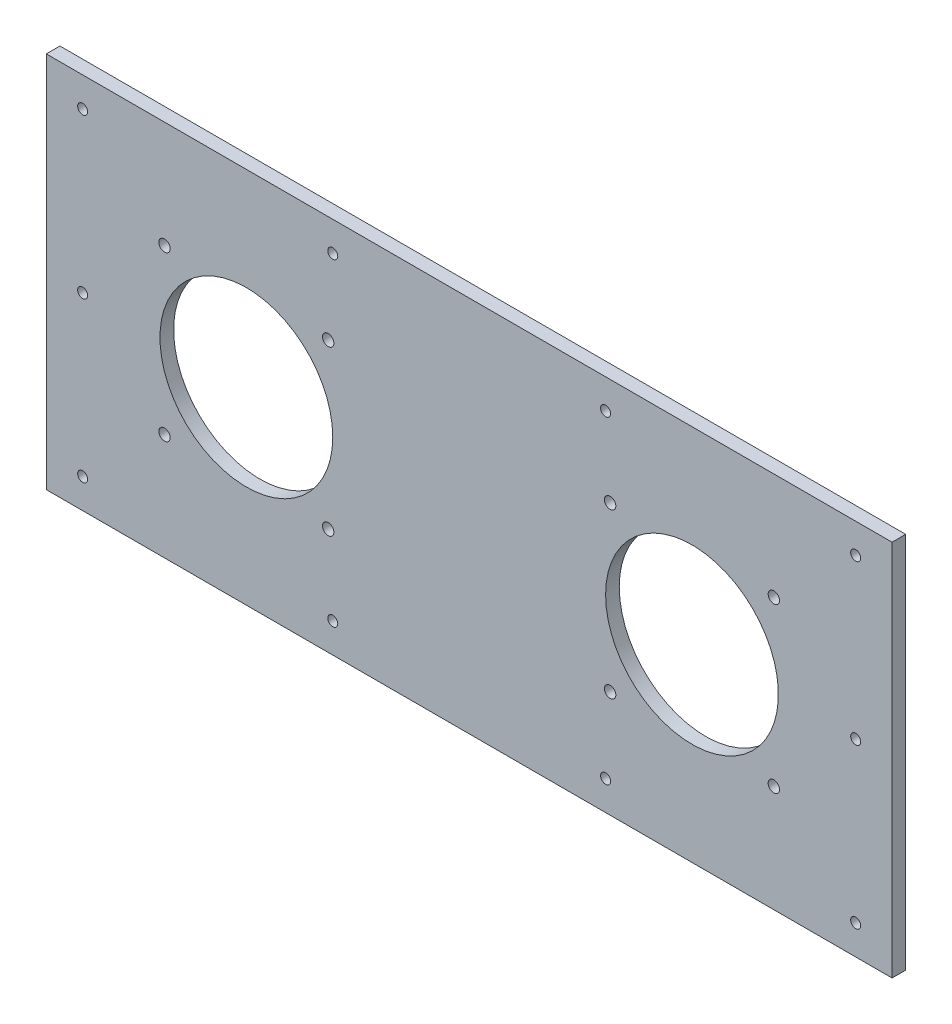
ISO-10303-21;
HEADER;
FILE_DESCRIPTION(('STEP AP214'),'2;1');
FILE_NAME('part.step','',(''),(''),'','','');
FILE_SCHEMA(('AUTOMOTIVE_DESIGN { 1 0 10303 214 1 1 1 1 }'));
ENDSEC;
DATA;
#1=APPLICATION_CONTEXT('core data for automotive mechanical design processes');
#2=APPLICATION_PROTOCOL_DEFINITION('international standard','automotive_design',2000,#1);
#3=PRODUCT_CONTEXT('',#1,'mechanical');
#4=PRODUCT('Part','Part','',(#3));
#5=PRODUCT_RELATED_PRODUCT_CATEGORY('part','',(#4));
#6=PRODUCT_DEFINITION_FORMATION('','',#4);
#7=PRODUCT_DEFINITION_CONTEXT('part definition',#1,'design');
#8=PRODUCT_DEFINITION('design','',#6,#7);
#9=PRODUCT_DEFINITION_SHAPE('','',#8);
#10=(LENGTH_UNIT() NAMED_UNIT(*) SI_UNIT(.MILLI.,.METRE.));
#11=(NAMED_UNIT(*) PLANE_ANGLE_UNIT() SI_UNIT($,.RADIAN.));
#12=(NAMED_UNIT(*) SI_UNIT($,.STERADIAN.) SOLID_ANGLE_UNIT());
#13=UNCERTAINTY_MEASURE_WITH_UNIT(LENGTH_MEASURE(1.E-05),#10,'distance_accuracy_value','');
#14=(GEOMETRIC_REPRESENTATION_CONTEXT(3) GLOBAL_UNCERTAINTY_ASSIGNED_CONTEXT((#13)) GLOBAL_UNIT_ASSIGNED_CONTEXT((#10,
#11,#12)) REPRESENTATION_CONTEXT('',''));
#15=CARTESIAN_POINT('',(0.,0.,0.));
#16=DIRECTION('',(0.,0.,1.));
#17=DIRECTION('',(1.,0.,0.));
#18=AXIS2_PLACEMENT_3D('',#15,#16,#17);
#19=CARTESIAN_POINT('',(0.,0.,6.));
#20=DIRECTION('',(0.,0.,-1.));
#21=DIRECTION('',(-1.,0.,0.));
#22=AXIS2_PLACEMENT_3D('',#19,#20,#21);
#23=PLANE('',#22);
#24=CARTESIAN_POINT('',(-134.,36.,6.));
#25=DIRECTION('',(0.,0.,1.));
#26=DIRECTION('',(1.,0.,0.));
#27=AXIS2_PLACEMENT_3D('',#24,#25,#26);
#28=CIRCLE('',#27,2.5);
#29=CARTESIAN_POINT('',(-131.5,36.,6.));
#30=VERTEX_POINT('',#29);
#31=EDGE_CURVE('E448',#30,#30,#28,.T.);
#32=ORIENTED_EDGE('',*,*,#31,.F.);
#33=EDGE_LOOP('',(#32));
#34=FACE_BOUND('',#33,.T.);
#35=CARTESIAN_POINT('',(-134.,-36.,6.));
#36=DIRECTION('',(0.,0.,1.));
#37=DIRECTION('',(-1.,0.,0.));
#38=AXIS2_PLACEMENT_3D('',#35,#36,#37);
#39=CIRCLE('',#38,2.5);
#40=CARTESIAN_POINT('',(-136.5,-36.,6.));
#41=VERTEX_POINT('',#40);
#42=EDGE_CURVE('E456',#41,#41,#39,.T.);
#43=ORIENTED_EDGE('',*,*,#42,.F.);
#44=EDGE_LOOP('',(#43));
#45=FACE_BOUND('',#44,.T.);
#46=CARTESIAN_POINT('',(-62.,-36.,6.));
#47=DIRECTION('',(0.,0.,1.));
#48=DIRECTION('',(1.,0.,0.));
#49=AXIS2_PLACEMENT_3D('',#46,#47,#48);
#50=CIRCLE('',#49,2.5);
#51=CARTESIAN_POINT('',(-59.5,-36.,6.));
#52=VERTEX_POINT('',#51);
#53=EDGE_CURVE('E464',#52,#52,#50,.T.);
#54=ORIENTED_EDGE('',*,*,#53,.F.);
#55=EDGE_LOOP('',(#54));
#56=FACE_BOUND('',#55,.T.);
#57=CARTESIAN_POINT('',(-62.,36.,6.));
#58=DIRECTION('',(0.,0.,1.));
#59=DIRECTION('',(-1.,0.,0.));
#60=AXIS2_PLACEMENT_3D('',#57,#58,#59);
#61=CIRCLE('',#60,2.50000000000001);
#62=CARTESIAN_POINT('',(-64.5,36.,6.));
#63=VERTEX_POINT('',#62);
#64=EDGE_CURVE('E472',#63,#63,#61,.T.);
#65=ORIENTED_EDGE('',*,*,#64,.F.);
#66=EDGE_LOOP('',(#65));
#67=FACE_BOUND('',#66,.T.);
#68=CARTESIAN_POINT('',(62.,36.,6.));
#69=DIRECTION('',(0.,0.,1.));
#70=DIRECTION('',(1.,0.,0.));
#71=AXIS2_PLACEMENT_3D('',#68,#69,#70);
#72=CIRCLE('',#71,2.50000000000001);
#73=CARTESIAN_POINT('',(64.5,36.,6.));
#74=VERTEX_POINT('',#73);
#75=EDGE_CURVE('E480',#74,#74,#72,.T.);
#76=ORIENTED_EDGE('',*,*,#75,.F.);
#77=EDGE_LOOP('',(#76));
#78=FACE_BOUND('',#77,.T.);
#79=CARTESIAN_POINT('',(61.9999999999999,-36.,6.));
#80=DIRECTION('',(0.,0.,1.));
#81=DIRECTION('',(-1.,0.,0.));
#82=AXIS2_PLACEMENT_3D('',#79,#80,#81);
#83=CIRCLE('',#82,2.5);
#84=CARTESIAN_POINT('',(59.5,-36.,6.));
#85=VERTEX_POINT('',#84);
#86=EDGE_CURVE('E488',#85,#85,#83,.T.);
#87=ORIENTED_EDGE('',*,*,#86,.F.);
#88=EDGE_LOOP('',(#87));
#89=FACE_BOUND('',#88,.T.);
#90=CARTESIAN_POINT('',(134.,-36.0000000000001,6.));
#91=DIRECTION('',(0.,0.,1.));
#92=DIRECTION('',(1.,0.,0.));
#93=AXIS2_PLACEMENT_3D('',#90,#91,#92);
#94=CIRCLE('',#93,2.5);
#95=CARTESIAN_POINT('',(136.5,-36.0000000000001,6.));
#96=VERTEX_POINT('',#95);
#97=EDGE_CURVE('E496',#96,#96,#94,.T.);
#98=ORIENTED_EDGE('',*,*,#97,.F.);
#99=EDGE_LOOP('',(#98));
#100=FACE_BOUND('',#99,.T.);
#101=CARTESIAN_POINT('',(134.,35.9999999999999,6.));
#102=DIRECTION('',(0.,0.,1.));
#103=DIRECTION('',(-1.,0.,0.));
#104=AXIS2_PLACEMENT_3D('',#101,#102,#103);
#105=CIRCLE('',#104,2.5);
#106=CARTESIAN_POINT('',(131.5,35.9999999999999,6.));
#107=VERTEX_POINT('',#106);
#108=EDGE_CURVE('E504',#107,#107,#105,.T.);
#109=ORIENTED_EDGE('',*,*,#108,.F.);
#110=EDGE_LOOP('',(#109));
#111=FACE_BOUND('',#110,.T.);
#112=CARTESIAN_POINT('',(98.,0.,6.));
#113=DIRECTION('',(0.,0.,1.));
#114=DIRECTION('',(-1.,0.,0.));
#115=AXIS2_PLACEMENT_3D('',#112,#113,#114);
#116=CIRCLE('',#115,38.);
#117=CARTESIAN_POINT('',(60.,0.,6.));
#118=VERTEX_POINT('',#117);
#119=EDGE_CURVE('E511',#118,#118,#116,.T.);
#120=ORIENTED_EDGE('',*,*,#119,.F.);
#121=EDGE_LOOP('',(#120));
#122=FACE_BOUND('',#121,.T.);
#123=CARTESIAN_POINT('',(-98.,0.,6.));
#124=DIRECTION('',(0.,0.,1.));
#125=DIRECTION('',(1.,0.,0.));
#126=AXIS2_PLACEMENT_3D('',#123,#124,#125);
#127=CIRCLE('',#126,38.);
#128=CARTESIAN_POINT('',(-60.,0.,6.));
#129=VERTEX_POINT('',#128);
#130=EDGE_CURVE('E142',#129,#129,#127,.T.);
#131=ORIENTED_EDGE('',*,*,#130,.F.);
#132=EDGE_LOOP('',(#131));
#133=FACE_BOUND('',#132,.T.);
#134=DIRECTION('',(0.,-1.,0.));
#135=VECTOR('',#134,1.);
#136=CARTESIAN_POINT('',(-186.,83.,6.));
#137=LINE('',#136,#135);
#138=CARTESIAN_POINT('',(-186.,83.,6.));
#139=VERTEX_POINT('',#138);
#140=CARTESIAN_POINT('',(-186.,-83.,6.));
#141=VERTEX_POINT('',#140);
#142=EDGE_CURVE('E95',#139,#141,#137,.T.);
#143=ORIENTED_EDGE('',*,*,#142,.T.);
#144=DIRECTION('',(1.,0.,0.));
#145=VECTOR('',#144,1.);
#146=CARTESIAN_POINT('',(186.,-83.,6.));
#147=LINE('',#146,#145);
#148=CARTESIAN_POINT('',(186.,-83.,6.));
#149=VERTEX_POINT('',#148);
#150=EDGE_CURVE('E90',#141,#149,#147,.T.);
#151=ORIENTED_EDGE('',*,*,#150,.T.);
#152=DIRECTION('',(0.,1.,0.));
#153=VECTOR('',#152,1.);
#154=CARTESIAN_POINT('',(186.,83.,6.));
#155=LINE('',#154,#153);
#156=CARTESIAN_POINT('',(186.,83.,6.));
#157=VERTEX_POINT('',#156);
#158=EDGE_CURVE('E93',#149,#157,#155,.T.);
#159=ORIENTED_EDGE('',*,*,#158,.T.);
#160=DIRECTION('',(-1.,0.,0.));
#161=VECTOR('',#160,1.);
#162=CARTESIAN_POINT('',(186.,83.,6.));
#163=LINE('',#162,#161);
#164=EDGE_CURVE('E60',#157,#139,#163,.T.);
#165=ORIENTED_EDGE('',*,*,#164,.T.);
#166=EDGE_LOOP('',(#143,#151,#159,#165));
#167=FACE_BOUND('',#166,.T.);
#168=CARTESIAN_POINT('',(-170.,70.,6.));
#169=DIRECTION('',(0.,0.,1.));
#170=DIRECTION('',(1.,0.,0.));
#171=AXIS2_PLACEMENT_3D('',#168,#169,#170);
#172=CIRCLE('',#171,2.20000000000001);
#173=CARTESIAN_POINT('',(-167.8,70.,6.));
#174=VERTEX_POINT('',#173);
#175=EDGE_CURVE('E123',#174,#174,#172,.T.);
#176=ORIENTED_EDGE('',*,*,#175,.F.);
#177=EDGE_LOOP('',(#176));
#178=FACE_BOUND('',#177,.T.);
#179=CARTESIAN_POINT('',(-60.,70.,6.));
#180=DIRECTION('',(0.,0.,1.));
#181=DIRECTION('',(1.,0.,0.));
#182=AXIS2_PLACEMENT_3D('',#179,#180,#181);
#183=CIRCLE('',#182,2.19999999999999);
#184=CARTESIAN_POINT('',(-57.8000000000001,70.,6.));
#185=VERTEX_POINT('',#184);
#186=EDGE_CURVE('E134',#185,#185,#183,.T.);
#187=ORIENTED_EDGE('',*,*,#186,.F.);
#188=EDGE_LOOP('',(#187));
#189=FACE_BOUND('',#188,.T.);
#190=CARTESIAN_POINT('',(59.9999999999999,70.,6.));
#191=DIRECTION('',(0.,0.,1.));
#192=DIRECTION('',(-1.,0.,0.));
#193=AXIS2_PLACEMENT_3D('',#190,#191,#192);
#194=CIRCLE('',#193,2.19999999999999);
#195=CARTESIAN_POINT('',(57.8,70.,6.));
#196=VERTEX_POINT('',#195);
#197=EDGE_CURVE('E215',#196,#196,#194,.T.);
#198=ORIENTED_EDGE('',*,*,#197,.F.);
#199=EDGE_LOOP('',(#198));
#200=FACE_BOUND('',#199,.T.);
#201=CARTESIAN_POINT('',(170.,70.,6.));
#202=DIRECTION('',(0.,0.,1.));
#203=DIRECTION('',(-1.,0.,0.));
#204=AXIS2_PLACEMENT_3D('',#201,#202,#203);
#205=CIRCLE('',#204,2.20000000000001);
#206=CARTESIAN_POINT('',(167.8,70.,6.));
#207=VERTEX_POINT('',#206);
#208=EDGE_CURVE('E206',#207,#207,#205,.T.);
#209=ORIENTED_EDGE('',*,*,#208,.F.);
#210=EDGE_LOOP('',(#209));
#211=FACE_BOUND('',#210,.T.);
#212=CARTESIAN_POINT('',(170.,-70.,6.));
#213=DIRECTION('',(0.,0.,1.));
#214=DIRECTION('',(1.,0.,0.));
#215=AXIS2_PLACEMENT_3D('',#212,#213,#214);
#216=CIRCLE('',#215,2.20000000000001);
#217=CARTESIAN_POINT('',(172.2,-70.,6.));
#218=VERTEX_POINT('',#217);
#219=EDGE_CURVE('E198',#218,#218,#216,.T.);
#220=ORIENTED_EDGE('',*,*,#219,.F.);
#221=EDGE_LOOP('',(#220));
#222=FACE_BOUND('',#221,.T.);
#223=CARTESIAN_POINT('',(59.9999999999999,-70.,6.));
#224=DIRECTION('',(0.,0.,1.));
#225=DIRECTION('',(1.,0.,0.));
#226=AXIS2_PLACEMENT_3D('',#223,#224,#225);
#227=CIRCLE('',#226,2.19999999999999);
#228=CARTESIAN_POINT('',(62.1999999999999,-70.,6.));
#229=VERTEX_POINT('',#228);
#230=EDGE_CURVE('E188',#229,#229,#227,.T.);
#231=ORIENTED_EDGE('',*,*,#230,.F.);
#232=EDGE_LOOP('',(#231));
#233=FACE_BOUND('',#232,.T.);
#234=CARTESIAN_POINT('',(-60.,-70.,6.));
#235=DIRECTION('',(0.,0.,1.));
#236=DIRECTION('',(-1.,0.,0.));
#237=AXIS2_PLACEMENT_3D('',#234,#235,#236);
#238=CIRCLE('',#237,2.19999999999999);
#239=CARTESIAN_POINT('',(-62.2,-70.,6.));
#240=VERTEX_POINT('',#239);
#241=EDGE_CURVE('E179',#240,#240,#238,.T.);
#242=ORIENTED_EDGE('',*,*,#241,.F.);
#243=EDGE_LOOP('',(#242));
#244=FACE_BOUND('',#243,.T.);
#245=CARTESIAN_POINT('',(-170.,-70.,6.));
#246=DIRECTION('',(0.,0.,1.));
#247=DIRECTION('',(-1.,0.,0.));
#248=AXIS2_PLACEMENT_3D('',#245,#246,#247);
#249=CIRCLE('',#248,2.20000000000001);
#250=CARTESIAN_POINT('',(-172.2,-70.,6.));
#251=VERTEX_POINT('',#250);
#252=EDGE_CURVE('E171',#251,#251,#249,.T.);
#253=ORIENTED_EDGE('',*,*,#252,.F.);
#254=EDGE_LOOP('',(#253));
#255=FACE_BOUND('',#254,.T.);
#256=CARTESIAN_POINT('',(-170.,0.,6.));
#257=DIRECTION('',(0.,0.,1.));
#258=DIRECTION('',(1.,0.,0.));
#259=AXIS2_PLACEMENT_3D('',#256,#257,#258);
#260=CIRCLE('',#259,2.20000000000001);
#261=CARTESIAN_POINT('',(-167.8,0.,6.));
#262=VERTEX_POINT('',#261);
#263=EDGE_CURVE('E160',#262,#262,#260,.T.);
#264=ORIENTED_EDGE('',*,*,#263,.F.);
#265=EDGE_LOOP('',(#264));
#266=FACE_BOUND('',#265,.T.);
#267=CARTESIAN_POINT('',(170.,1.7205389523672E-13,6.));
#268=DIRECTION('',(0.,0.,1.));
#269=DIRECTION('',(-1.,0.,0.));
#270=AXIS2_PLACEMENT_3D('',#267,#268,#269);
#271=CIRCLE('',#270,2.20000000000001);
#272=CARTESIAN_POINT('',(167.8,1.7205389523672E-13,6.));
#273=VERTEX_POINT('',#272);
#274=EDGE_CURVE('E150',#273,#273,#271,.T.);
#275=ORIENTED_EDGE('',*,*,#274,.F.);
#276=EDGE_LOOP('',(#275));
#277=FACE_BOUND('',#276,.T.);
#278=ADVANCED_FACE('F42',(#34,#45,#56,#67,#78,#89,#100,#111,#122,#133,#167,#178,#189,#200,#211,
#222,#233,#244,#255,#266,#277),#23,.F.);
#279=CARTESIAN_POINT('',(0.,0.,0.));
#280=DIRECTION('',(0.,0.,-1.));
#281=DIRECTION('',(-1.,0.,0.));
#282=AXIS2_PLACEMENT_3D('',#279,#280,#281);
#283=PLANE('',#282);
#284=CARTESIAN_POINT('',(-134.,36.,0.));
#285=DIRECTION('',(0.,0.,1.));
#286=DIRECTION('',(1.,0.,0.));
#287=AXIS2_PLACEMENT_3D('',#284,#285,#286);
#288=CIRCLE('',#287,2.5);
#289=CARTESIAN_POINT('',(-131.5,36.,0.));
#290=VERTEX_POINT('',#289);
#291=EDGE_CURVE('E148',#290,#290,#288,.T.);
#292=ORIENTED_EDGE('',*,*,#291,.T.);
#293=EDGE_LOOP('',(#292));
#294=FACE_BOUND('',#293,.T.);
#295=CARTESIAN_POINT('',(-134.,-36.,0.));
#296=DIRECTION('',(0.,0.,1.));
#297=DIRECTION('',(-1.,0.,0.));
#298=AXIS2_PLACEMENT_3D('',#295,#296,#297);
#299=CIRCLE('',#298,2.5);
#300=CARTESIAN_POINT('',(-136.5,-36.,0.));
#301=VERTEX_POINT('',#300);
#302=EDGE_CURVE('E452',#301,#301,#299,.T.);
#303=ORIENTED_EDGE('',*,*,#302,.T.);
#304=EDGE_LOOP('',(#303));
#305=FACE_BOUND('',#304,.T.);
#306=CARTESIAN_POINT('',(-62.,-36.,0.));
#307=DIRECTION('',(0.,0.,1.));
#308=DIRECTION('',(1.,0.,0.));
#309=AXIS2_PLACEMENT_3D('',#306,#307,#308);
#310=CIRCLE('',#309,2.5);
#311=CARTESIAN_POINT('',(-59.5,-36.,0.));
#312=VERTEX_POINT('',#311);
#313=EDGE_CURVE('E460',#312,#312,#310,.T.);
#314=ORIENTED_EDGE('',*,*,#313,.T.);
#315=EDGE_LOOP('',(#314));
#316=FACE_BOUND('',#315,.T.);
#317=CARTESIAN_POINT('',(-62.,36.,0.));
#318=DIRECTION('',(0.,0.,1.));
#319=DIRECTION('',(-1.,0.,0.));
#320=AXIS2_PLACEMENT_3D('',#317,#318,#319);
#321=CIRCLE('',#320,2.50000000000001);
#322=CARTESIAN_POINT('',(-64.5,36.,0.));
#323=VERTEX_POINT('',#322);
#324=EDGE_CURVE('E468',#323,#323,#321,.T.);
#325=ORIENTED_EDGE('',*,*,#324,.T.);
#326=EDGE_LOOP('',(#325));
#327=FACE_BOUND('',#326,.T.);
#328=CARTESIAN_POINT('',(62.,36.,0.));
#329=DIRECTION('',(0.,0.,1.));
#330=DIRECTION('',(1.,0.,0.));
#331=AXIS2_PLACEMENT_3D('',#328,#329,#330);
#332=CIRCLE('',#331,2.50000000000001);
#333=CARTESIAN_POINT('',(64.5,36.,0.));
#334=VERTEX_POINT('',#333);
#335=EDGE_CURVE('E476',#334,#334,#332,.T.);
#336=ORIENTED_EDGE('',*,*,#335,.T.);
#337=EDGE_LOOP('',(#336));
#338=FACE_BOUND('',#337,.T.);
#339=CARTESIAN_POINT('',(61.9999999999999,-36.,0.));
#340=DIRECTION('',(0.,0.,1.));
#341=DIRECTION('',(-1.,0.,0.));
#342=AXIS2_PLACEMENT_3D('',#339,#340,#341);
#343=CIRCLE('',#342,2.5);
#344=CARTESIAN_POINT('',(59.5,-36.,0.));
#345=VERTEX_POINT('',#344);
#346=EDGE_CURVE('E484',#345,#345,#343,.T.);
#347=ORIENTED_EDGE('',*,*,#346,.T.);
#348=EDGE_LOOP('',(#347));
#349=FACE_BOUND('',#348,.T.);
#350=CARTESIAN_POINT('',(134.,-36.0000000000001,0.));
#351=DIRECTION('',(0.,0.,1.));
#352=DIRECTION('',(1.,0.,0.));
#353=AXIS2_PLACEMENT_3D('',#350,#351,#352);
#354=CIRCLE('',#353,2.5);
#355=CARTESIAN_POINT('',(136.5,-36.0000000000001,0.));
#356=VERTEX_POINT('',#355);
#357=EDGE_CURVE('E492',#356,#356,#354,.T.);
#358=ORIENTED_EDGE('',*,*,#357,.T.);
#359=EDGE_LOOP('',(#358));
#360=FACE_BOUND('',#359,.T.);
#361=CARTESIAN_POINT('',(134.,35.9999999999999,0.));
#362=DIRECTION('',(0.,0.,1.));
#363=DIRECTION('',(-1.,0.,0.));
#364=AXIS2_PLACEMENT_3D('',#361,#362,#363);
#365=CIRCLE('',#364,2.5);
#366=CARTESIAN_POINT('',(131.5,35.9999999999999,0.));
#367=VERTEX_POINT('',#366);
#368=EDGE_CURVE('E500',#367,#367,#365,.T.);
#369=ORIENTED_EDGE('',*,*,#368,.T.);
#370=EDGE_LOOP('',(#369));
#371=FACE_BOUND('',#370,.T.);
#372=CARTESIAN_POINT('',(98.,0.,0.));
#373=DIRECTION('',(0.,0.,1.));
#374=DIRECTION('',(-1.,0.,0.));
#375=AXIS2_PLACEMENT_3D('',#372,#373,#374);
#376=CIRCLE('',#375,38.);
#377=CARTESIAN_POINT('',(60.,0.,0.));
#378=VERTEX_POINT('',#377);
#379=EDGE_CURVE('E508',#378,#378,#376,.T.);
#380=ORIENTED_EDGE('',*,*,#379,.T.);
#381=EDGE_LOOP('',(#380));
#382=FACE_BOUND('',#381,.T.);
#383=CARTESIAN_POINT('',(-98.,0.,0.));
#384=DIRECTION('',(0.,0.,1.));
#385=DIRECTION('',(1.,0.,0.));
#386=AXIS2_PLACEMENT_3D('',#383,#384,#385);
#387=CIRCLE('',#386,38.);
#388=CARTESIAN_POINT('',(-60.,0.,0.));
#389=VERTEX_POINT('',#388);
#390=EDGE_CURVE('E147',#389,#389,#387,.T.);
#391=ORIENTED_EDGE('',*,*,#390,.T.);
#392=EDGE_LOOP('',(#391));
#393=FACE_BOUND('',#392,.T.);
#394=CARTESIAN_POINT('',(-170.,0.,0.));
#395=DIRECTION('',(0.,0.,1.));
#396=DIRECTION('',(1.,0.,0.));
#397=AXIS2_PLACEMENT_3D('',#394,#395,#396);
#398=CIRCLE('',#397,2.20000000000001);
#399=CARTESIAN_POINT('',(-167.8,0.,0.));
#400=VERTEX_POINT('',#399);
#401=EDGE_CURVE('E155',#400,#400,#398,.T.);
#402=ORIENTED_EDGE('',*,*,#401,.T.);
#403=EDGE_LOOP('',(#402));
#404=FACE_BOUND('',#403,.T.);
#405=CARTESIAN_POINT('',(-60.,-70.,0.));
#406=DIRECTION('',(0.,0.,1.));
#407=DIRECTION('',(-1.,0.,0.));
#408=AXIS2_PLACEMENT_3D('',#405,#406,#407);
#409=CIRCLE('',#408,2.19999999999999);
#410=CARTESIAN_POINT('',(-62.2,-70.,0.));
#411=VERTEX_POINT('',#410);
#412=EDGE_CURVE('E176',#411,#411,#409,.T.);
#413=ORIENTED_EDGE('',*,*,#412,.T.);
#414=EDGE_LOOP('',(#413));
#415=FACE_BOUND('',#414,.T.);
#416=CARTESIAN_POINT('',(170.,-70.,0.));
#417=DIRECTION('',(0.,0.,1.));
#418=DIRECTION('',(1.,0.,0.));
#419=AXIS2_PLACEMENT_3D('',#416,#417,#418);
#420=CIRCLE('',#419,2.20000000000001);
#421=CARTESIAN_POINT('',(172.2,-70.,0.));
#422=VERTEX_POINT('',#421);
#423=EDGE_CURVE('E193',#422,#422,#420,.T.);
#424=ORIENTED_EDGE('',*,*,#423,.T.);
#425=EDGE_LOOP('',(#424));
#426=FACE_BOUND('',#425,.T.);
#427=CARTESIAN_POINT('',(59.9999999999999,70.,0.));
#428=DIRECTION('',(0.,0.,1.));
#429=DIRECTION('',(-1.,0.,0.));
#430=AXIS2_PLACEMENT_3D('',#427,#428,#429);
#431=CIRCLE('',#430,2.19999999999999);
#432=CARTESIAN_POINT('',(57.8,70.,0.));
#433=VERTEX_POINT('',#432);
#434=EDGE_CURVE('E211',#433,#433,#431,.T.);
#435=ORIENTED_EDGE('',*,*,#434,.T.);
#436=EDGE_LOOP('',(#435));
#437=FACE_BOUND('',#436,.T.);
#438=CARTESIAN_POINT('',(-170.,70.,0.));
#439=DIRECTION('',(0.,0.,1.));
#440=DIRECTION('',(1.,0.,0.));
#441=AXIS2_PLACEMENT_3D('',#438,#439,#440);
#442=CIRCLE('',#441,2.20000000000001);
#443=CARTESIAN_POINT('',(-167.8,70.,0.));
#444=VERTEX_POINT('',#443);
#445=EDGE_CURVE('E130',#444,#444,#442,.T.);
#446=ORIENTED_EDGE('',*,*,#445,.T.);
#447=EDGE_LOOP('',(#446));
#448=FACE_BOUND('',#447,.T.);
#449=DIRECTION('',(0.,-1.,0.));
#450=VECTOR('',#449,1.);
#451=CARTESIAN_POINT('',(-186.,83.,0.));
#452=LINE('',#451,#450);
#453=CARTESIAN_POINT('',(-186.,83.,0.));
#454=VERTEX_POINT('',#453);
#455=CARTESIAN_POINT('',(-186.,-83.,0.));
#456=VERTEX_POINT('',#455);
#457=EDGE_CURVE('E129',#454,#456,#452,.T.);
#458=ORIENTED_EDGE('',*,*,#457,.F.);
#459=DIRECTION('',(-1.,0.,0.));
#460=VECTOR('',#459,1.);
#461=CARTESIAN_POINT('',(186.,83.,0.));
#462=LINE('',#461,#460);
#463=CARTESIAN_POINT('',(186.,83.,0.));
#464=VERTEX_POINT('',#463);
#465=EDGE_CURVE('E83',#464,#454,#462,.T.);
#466=ORIENTED_EDGE('',*,*,#465,.F.);
#467=DIRECTION('',(0.,1.,0.));
#468=VECTOR('',#467,1.);
#469=CARTESIAN_POINT('',(186.,83.,0.));
#470=LINE('',#469,#468);
#471=CARTESIAN_POINT('',(186.,-83.,0.));
#472=VERTEX_POINT('',#471);
#473=EDGE_CURVE('E77',#472,#464,#470,.T.);
#474=ORIENTED_EDGE('',*,*,#473,.F.);
#475=DIRECTION('',(1.,0.,0.));
#476=VECTOR('',#475,1.);
#477=CARTESIAN_POINT('',(186.,-83.,0.));
#478=LINE('',#477,#476);
#479=EDGE_CURVE('E100',#456,#472,#478,.T.);
#480=ORIENTED_EDGE('',*,*,#479,.F.);
#481=EDGE_LOOP('',(#458,#466,#474,#480));
#482=FACE_BOUND('',#481,.T.);
#483=CARTESIAN_POINT('',(-60.,70.,0.));
#484=DIRECTION('',(0.,0.,1.));
#485=DIRECTION('',(1.,0.,0.));
#486=AXIS2_PLACEMENT_3D('',#483,#484,#485);
#487=CIRCLE('',#486,2.19999999999999);
#488=CARTESIAN_POINT('',(-57.8000000000001,70.,0.));
#489=VERTEX_POINT('',#488);
#490=EDGE_CURVE('E131',#489,#489,#487,.T.);
#491=ORIENTED_EDGE('',*,*,#490,.T.);
#492=EDGE_LOOP('',(#491));
#493=FACE_BOUND('',#492,.T.);
#494=CARTESIAN_POINT('',(170.,70.,0.));
#495=DIRECTION('',(0.,0.,1.));
#496=DIRECTION('',(-1.,0.,0.));
#497=AXIS2_PLACEMENT_3D('',#494,#495,#496);
#498=CIRCLE('',#497,2.20000000000001);
#499=CARTESIAN_POINT('',(167.8,70.,0.));
#500=VERTEX_POINT('',#499);
#501=EDGE_CURVE('E203',#500,#500,#498,.T.);
#502=ORIENTED_EDGE('',*,*,#501,.T.);
#503=EDGE_LOOP('',(#502));
#504=FACE_BOUND('',#503,.T.);
#505=CARTESIAN_POINT('',(59.9999999999999,-70.,0.));
#506=DIRECTION('',(0.,0.,1.));
#507=DIRECTION('',(1.,0.,0.));
#508=AXIS2_PLACEMENT_3D('',#505,#506,#507);
#509=CIRCLE('',#508,2.19999999999999);
#510=CARTESIAN_POINT('',(62.1999999999999,-70.,0.));
#511=VERTEX_POINT('',#510);
#512=EDGE_CURVE('E184',#511,#511,#509,.T.);
#513=ORIENTED_EDGE('',*,*,#512,.T.);
#514=EDGE_LOOP('',(#513));
#515=FACE_BOUND('',#514,.T.);
#516=CARTESIAN_POINT('',(-170.,-70.,0.));
#517=DIRECTION('',(0.,0.,1.));
#518=DIRECTION('',(-1.,0.,0.));
#519=AXIS2_PLACEMENT_3D('',#516,#517,#518);
#520=CIRCLE('',#519,2.20000000000001);
#521=CARTESIAN_POINT('',(-172.2,-70.,0.));
#522=VERTEX_POINT('',#521);
#523=EDGE_CURVE('E165',#522,#522,#520,.T.);
#524=ORIENTED_EDGE('',*,*,#523,.T.);
#525=EDGE_LOOP('',(#524));
#526=FACE_BOUND('',#525,.T.);
#527=CARTESIAN_POINT('',(170.,1.7205389523672E-13,0.));
#528=DIRECTION('',(0.,0.,1.));
#529=DIRECTION('',(-1.,0.,0.));
#530=AXIS2_PLACEMENT_3D('',#527,#528,#529);
#531=CIRCLE('',#530,2.20000000000001);
#532=CARTESIAN_POINT('',(167.8,1.7205389523672E-13,0.));
#533=VERTEX_POINT('',#532);
#534=EDGE_CURVE('E156',#533,#533,#531,.T.);
#535=ORIENTED_EDGE('',*,*,#534,.T.);
#536=EDGE_LOOP('',(#535));
#537=FACE_BOUND('',#536,.T.);
#538=ADVANCED_FACE('F231',(#294,#305,#316,#327,#338,#349,#360,#371,#382,#393,#404,#415,#426,
#437,#448,#482,#493,#504,#515,#526,#537),#283,.T.);
#539=CARTESIAN_POINT('',(-186.,83.,6.));
#540=DIRECTION('',(1.,0.,0.));
#541=DIRECTION('',(0.,1.,0.));
#542=AXIS2_PLACEMENT_3D('',#539,#540,#541);
#543=PLANE('',#542);
#544=ORIENTED_EDGE('',*,*,#457,.T.);
#545=DIRECTION('',(0.,0.,-1.));
#546=VECTOR('',#545,1.);
#547=CARTESIAN_POINT('',(-186.,-83.,6.));
#548=LINE('',#547,#546);
#549=EDGE_CURVE('E12',#141,#456,#548,.T.);
#550=ORIENTED_EDGE('',*,*,#549,.F.);
#551=ORIENTED_EDGE('',*,*,#142,.F.);
#552=DIRECTION('',(0.,0.,-1.));
#553=VECTOR('',#552,1.);
#554=CARTESIAN_POINT('',(-186.,83.,6.));
#555=LINE('',#554,#553);
#556=EDGE_CURVE('E107',#139,#454,#555,.T.);
#557=ORIENTED_EDGE('',*,*,#556,.T.);
#558=EDGE_LOOP('',(#544,#550,#551,#557));
#559=FACE_BOUND('',#558,.T.);
#560=ADVANCED_FACE('F44',(#559),#543,.F.);
#561=CARTESIAN_POINT('',(186.,-83.,6.));
#562=DIRECTION('',(0.,1.,0.));
#563=DIRECTION('',(-1.,0.,0.));
#564=AXIS2_PLACEMENT_3D('',#561,#562,#563);
#565=PLANE('',#564);
#566=ORIENTED_EDGE('',*,*,#479,.T.);
#567=DIRECTION('',(0.,0.,-1.));
#568=VECTOR('',#567,1.);
#569=CARTESIAN_POINT('',(186.,-83.,6.));
#570=LINE('',#569,#568);
#571=EDGE_CURVE('E52',#149,#472,#570,.T.);
#572=ORIENTED_EDGE('',*,*,#571,.F.);
#573=ORIENTED_EDGE('',*,*,#150,.F.);
#574=ORIENTED_EDGE('',*,*,#549,.T.);
#575=EDGE_LOOP('',(#566,#572,#573,#574));
#576=FACE_BOUND('',#575,.T.);
#577=ADVANCED_FACE('F99',(#576),#565,.F.);
#578=CARTESIAN_POINT('',(186.,83.,6.));
#579=DIRECTION('',(-1.,0.,0.));
#580=DIRECTION('',(0.,-1.,0.));
#581=AXIS2_PLACEMENT_3D('',#578,#579,#580);
#582=PLANE('',#581);
#583=ORIENTED_EDGE('',*,*,#473,.T.);
#584=DIRECTION('',(0.,0.,-1.));
#585=VECTOR('',#584,1.);
#586=CARTESIAN_POINT('',(186.,83.,6.));
#587=LINE('',#586,#585);
#588=EDGE_CURVE('E102',#157,#464,#587,.T.);
#589=ORIENTED_EDGE('',*,*,#588,.F.);
#590=ORIENTED_EDGE('',*,*,#158,.F.);
#591=ORIENTED_EDGE('',*,*,#571,.T.);
#592=EDGE_LOOP('',(#583,#589,#590,#591));
#593=FACE_BOUND('',#592,.T.);
#594=ADVANCED_FACE('F103',(#593),#582,.F.);
#595=CARTESIAN_POINT('',(186.,83.,6.));
#596=DIRECTION('',(0.,-1.,0.));
#597=DIRECTION('',(1.,0.,0.));
#598=AXIS2_PLACEMENT_3D('',#595,#596,#597);
#599=PLANE('',#598);
#600=ORIENTED_EDGE('',*,*,#465,.T.);
#601=ORIENTED_EDGE('',*,*,#556,.F.);
#602=ORIENTED_EDGE('',*,*,#164,.F.);
#603=ORIENTED_EDGE('',*,*,#588,.T.);
#604=EDGE_LOOP('',(#600,#601,#602,#603));
#605=FACE_BOUND('',#604,.T.);
#606=ADVANCED_FACE('F246',(#605),#599,.F.);
#607=CARTESIAN_POINT('',(-170.,70.,6.));
#608=DIRECTION('',(0.,0.,-1.));
#609=DIRECTION('',(-1.,0.,0.));
#610=AXIS2_PLACEMENT_3D('',#607,#608,#609);
#611=CYLINDRICAL_SURFACE('',#610,2.20000000000001);
#612=ORIENTED_EDGE('',*,*,#175,.T.);
#613=EDGE_LOOP('',(#612));
#614=FACE_BOUND('',#613,.T.);
#615=ORIENTED_EDGE('',*,*,#445,.F.);
#616=EDGE_LOOP('',(#615));
#617=FACE_BOUND('',#616,.T.);
#618=ADVANCED_FACE('F237',(#614,#617),#611,.F.);
#619=CARTESIAN_POINT('',(-60.,70.,6.));
#620=DIRECTION('',(0.,0.,-1.));
#621=DIRECTION('',(-1.,0.,0.));
#622=AXIS2_PLACEMENT_3D('',#619,#620,#621);
#623=CYLINDRICAL_SURFACE('',#622,2.19999999999999);
#624=ORIENTED_EDGE('',*,*,#186,.T.);
#625=EDGE_LOOP('',(#624));
#626=FACE_BOUND('',#625,.T.);
#627=ORIENTED_EDGE('',*,*,#490,.F.);
#628=EDGE_LOOP('',(#627));
#629=FACE_BOUND('',#628,.T.);
#630=ADVANCED_FACE('F234',(#626,#629),#623,.F.);
#631=CARTESIAN_POINT('',(59.9999999999999,70.,6.));
#632=DIRECTION('',(0.,0.,-1.));
#633=DIRECTION('',(-1.,0.,0.));
#634=AXIS2_PLACEMENT_3D('',#631,#632,#633);
#635=CYLINDRICAL_SURFACE('',#634,2.19999999999999);
#636=ORIENTED_EDGE('',*,*,#197,.T.);
#637=EDGE_LOOP('',(#636));
#638=FACE_BOUND('',#637,.T.);
#639=ORIENTED_EDGE('',*,*,#434,.F.);
#640=EDGE_LOOP('',(#639));
#641=FACE_BOUND('',#640,.T.);
#642=ADVANCED_FACE('F236',(#638,#641),#635,.F.);
#643=CARTESIAN_POINT('',(170.,70.,6.));
#644=DIRECTION('',(0.,0.,-1.));
#645=DIRECTION('',(-1.,0.,0.));
#646=AXIS2_PLACEMENT_3D('',#643,#644,#645);
#647=CYLINDRICAL_SURFACE('',#646,2.20000000000001);
#648=ORIENTED_EDGE('',*,*,#208,.T.);
#649=EDGE_LOOP('',(#648));
#650=FACE_BOUND('',#649,.T.);
#651=ORIENTED_EDGE('',*,*,#501,.F.);
#652=EDGE_LOOP('',(#651));
#653=FACE_BOUND('',#652,.T.);
#654=ADVANCED_FACE('F243',(#650,#653),#647,.F.);
#655=CARTESIAN_POINT('',(170.,-70.,6.));
#656=DIRECTION('',(0.,0.,-1.));
#657=DIRECTION('',(-1.,0.,0.));
#658=AXIS2_PLACEMENT_3D('',#655,#656,#657);
#659=CYLINDRICAL_SURFACE('',#658,2.20000000000001);
#660=ORIENTED_EDGE('',*,*,#219,.T.);
#661=EDGE_LOOP('',(#660));
#662=FACE_BOUND('',#661,.T.);
#663=ORIENTED_EDGE('',*,*,#423,.F.);
#664=EDGE_LOOP('',(#663));
#665=FACE_BOUND('',#664,.T.);
#666=ADVANCED_FACE('F418',(#662,#665),#659,.F.);
#667=CARTESIAN_POINT('',(59.9999999999999,-70.,6.));
#668=DIRECTION('',(0.,0.,-1.));
#669=DIRECTION('',(-1.,0.,0.));
#670=AXIS2_PLACEMENT_3D('',#667,#668,#669);
#671=CYLINDRICAL_SURFACE('',#670,2.19999999999999);
#672=ORIENTED_EDGE('',*,*,#230,.T.);
#673=EDGE_LOOP('',(#672));
#674=FACE_BOUND('',#673,.T.);
#675=ORIENTED_EDGE('',*,*,#512,.F.);
#676=EDGE_LOOP('',(#675));
#677=FACE_BOUND('',#676,.T.);
#678=ADVANCED_FACE('F414',(#674,#677),#671,.F.);
#679=CARTESIAN_POINT('',(-60.,-70.,6.));
#680=DIRECTION('',(0.,0.,-1.));
#681=DIRECTION('',(-1.,0.,0.));
#682=AXIS2_PLACEMENT_3D('',#679,#680,#681);
#683=CYLINDRICAL_SURFACE('',#682,2.19999999999999);
#684=ORIENTED_EDGE('',*,*,#241,.T.);
#685=EDGE_LOOP('',(#684));
#686=FACE_BOUND('',#685,.T.);
#687=ORIENTED_EDGE('',*,*,#412,.F.);
#688=EDGE_LOOP('',(#687));
#689=FACE_BOUND('',#688,.T.);
#690=ADVANCED_FACE('F410',(#686,#689),#683,.F.);
#691=CARTESIAN_POINT('',(-170.,-70.,6.));
#692=DIRECTION('',(0.,0.,-1.));
#693=DIRECTION('',(-1.,0.,0.));
#694=AXIS2_PLACEMENT_3D('',#691,#692,#693);
#695=CYLINDRICAL_SURFACE('',#694,2.20000000000001);
#696=ORIENTED_EDGE('',*,*,#252,.T.);
#697=EDGE_LOOP('',(#696));
#698=FACE_BOUND('',#697,.T.);
#699=ORIENTED_EDGE('',*,*,#523,.F.);
#700=EDGE_LOOP('',(#699));
#701=FACE_BOUND('',#700,.T.);
#702=ADVANCED_FACE('F406',(#698,#701),#695,.F.);
#703=CARTESIAN_POINT('',(-170.,0.,6.));
#704=DIRECTION('',(0.,0.,-1.));
#705=DIRECTION('',(-1.,0.,0.));
#706=AXIS2_PLACEMENT_3D('',#703,#704,#705);
#707=CYLINDRICAL_SURFACE('',#706,2.20000000000001);
#708=ORIENTED_EDGE('',*,*,#263,.T.);
#709=EDGE_LOOP('',(#708));
#710=FACE_BOUND('',#709,.T.);
#711=ORIENTED_EDGE('',*,*,#401,.F.);
#712=EDGE_LOOP('',(#711));
#713=FACE_BOUND('',#712,.T.);
#714=ADVANCED_FACE('F402',(#710,#713),#707,.F.);
#715=CARTESIAN_POINT('',(170.,1.7205389523672E-13,6.));
#716=DIRECTION('',(0.,0.,-1.));
#717=DIRECTION('',(-1.,0.,0.));
#718=AXIS2_PLACEMENT_3D('',#715,#716,#717);
#719=CYLINDRICAL_SURFACE('',#718,2.20000000000001);
#720=ORIENTED_EDGE('',*,*,#274,.T.);
#721=EDGE_LOOP('',(#720));
#722=FACE_BOUND('',#721,.T.);
#723=ORIENTED_EDGE('',*,*,#534,.F.);
#724=EDGE_LOOP('',(#723));
#725=FACE_BOUND('',#724,.T.);
#726=ADVANCED_FACE('F302',(#722,#725),#719,.F.);
#727=CARTESIAN_POINT('',(-98.,0.,0.));
#728=DIRECTION('',(0.,0.,1.));
#729=DIRECTION('',(1.,0.,0.));
#730=AXIS2_PLACEMENT_3D('',#727,#728,#729);
#731=CYLINDRICAL_SURFACE('',#730,38.);
#732=ORIENTED_EDGE('',*,*,#390,.F.);
#733=EDGE_LOOP('',(#732));
#734=FACE_BOUND('',#733,.T.);
#735=ORIENTED_EDGE('',*,*,#130,.T.);
#736=EDGE_LOOP('',(#735));
#737=FACE_BOUND('',#736,.T.);
#738=ADVANCED_FACE('F296',(#734,#737),#731,.F.);
#739=CARTESIAN_POINT('',(98.,0.,0.));
#740=DIRECTION('',(0.,0.,1.));
#741=DIRECTION('',(1.,0.,0.));
#742=AXIS2_PLACEMENT_3D('',#739,#740,#741);
#743=CYLINDRICAL_SURFACE('',#742,38.);
#744=ORIENTED_EDGE('',*,*,#379,.F.);
#745=EDGE_LOOP('',(#744));
#746=FACE_BOUND('',#745,.T.);
#747=ORIENTED_EDGE('',*,*,#119,.T.);
#748=EDGE_LOOP('',(#747));
#749=FACE_BOUND('',#748,.T.);
#750=ADVANCED_FACE('F301',(#746,#749),#743,.F.);
#751=CARTESIAN_POINT('',(134.,35.9999999999999,0.));
#752=DIRECTION('',(0.,0.,1.));
#753=DIRECTION('',(1.,0.,0.));
#754=AXIS2_PLACEMENT_3D('',#751,#752,#753);
#755=CYLINDRICAL_SURFACE('',#754,2.5);
#756=ORIENTED_EDGE('',*,*,#368,.F.);
#757=EDGE_LOOP('',(#756));
#758=FACE_BOUND('',#757,.T.);
#759=ORIENTED_EDGE('',*,*,#108,.T.);
#760=EDGE_LOOP('',(#759));
#761=FACE_BOUND('',#760,.T.);
#762=ADVANCED_FACE('F314',(#758,#761),#755,.F.);
#763=CARTESIAN_POINT('',(134.,-36.0000000000001,0.));
#764=DIRECTION('',(0.,0.,1.));
#765=DIRECTION('',(1.,0.,0.));
#766=AXIS2_PLACEMENT_3D('',#763,#764,#765);
#767=CYLINDRICAL_SURFACE('',#766,2.5);
#768=ORIENTED_EDGE('',*,*,#357,.F.);
#769=EDGE_LOOP('',(#768));
#770=FACE_BOUND('',#769,.T.);
#771=ORIENTED_EDGE('',*,*,#97,.T.);
#772=EDGE_LOOP('',(#771));
#773=FACE_BOUND('',#772,.T.);
#774=ADVANCED_FACE('F324',(#770,#773),#767,.F.);
#775=CARTESIAN_POINT('',(61.9999999999999,-36.,0.));
#776=DIRECTION('',(0.,0.,1.));
#777=DIRECTION('',(1.,0.,0.));
#778=AXIS2_PLACEMENT_3D('',#775,#776,#777);
#779=CYLINDRICAL_SURFACE('',#778,2.5);
#780=ORIENTED_EDGE('',*,*,#346,.F.);
#781=EDGE_LOOP('',(#780));
#782=FACE_BOUND('',#781,.T.);
#783=ORIENTED_EDGE('',*,*,#86,.T.);
#784=EDGE_LOOP('',(#783));
#785=FACE_BOUND('',#784,.T.);
#786=ADVANCED_FACE('F334',(#782,#785),#779,.F.);
#787=CARTESIAN_POINT('',(62.,36.,0.));
#788=DIRECTION('',(0.,0.,1.));
#789=DIRECTION('',(1.,0.,0.));
#790=AXIS2_PLACEMENT_3D('',#787,#788,#789);
#791=CYLINDRICAL_SURFACE('',#790,2.50000000000001);
#792=ORIENTED_EDGE('',*,*,#335,.F.);
#793=EDGE_LOOP('',(#792));
#794=FACE_BOUND('',#793,.T.);
#795=ORIENTED_EDGE('',*,*,#75,.T.);
#796=EDGE_LOOP('',(#795));
#797=FACE_BOUND('',#796,.T.);
#798=ADVANCED_FACE('F344',(#794,#797),#791,.F.);
#799=CARTESIAN_POINT('',(-62.,36.,0.));
#800=DIRECTION('',(0.,0.,1.));
#801=DIRECTION('',(1.,0.,0.));
#802=AXIS2_PLACEMENT_3D('',#799,#800,#801);
#803=CYLINDRICAL_SURFACE('',#802,2.50000000000001);
#804=ORIENTED_EDGE('',*,*,#324,.F.);
#805=EDGE_LOOP('',(#804));
#806=FACE_BOUND('',#805,.T.);
#807=ORIENTED_EDGE('',*,*,#64,.T.);
#808=EDGE_LOOP('',(#807));
#809=FACE_BOUND('',#808,.T.);
#810=ADVANCED_FACE('F354',(#806,#809),#803,.F.);
#811=CARTESIAN_POINT('',(-62.,-36.,0.));
#812=DIRECTION('',(0.,0.,1.));
#813=DIRECTION('',(1.,0.,0.));
#814=AXIS2_PLACEMENT_3D('',#811,#812,#813);
#815=CYLINDRICAL_SURFACE('',#814,2.5);
#816=ORIENTED_EDGE('',*,*,#313,.F.);
#817=EDGE_LOOP('',(#816));
#818=FACE_BOUND('',#817,.T.);
#819=ORIENTED_EDGE('',*,*,#53,.T.);
#820=EDGE_LOOP('',(#819));
#821=FACE_BOUND('',#820,.T.);
#822=ADVANCED_FACE('F364',(#818,#821),#815,.F.);
#823=CARTESIAN_POINT('',(-134.,-36.,0.));
#824=DIRECTION('',(0.,0.,1.));
#825=DIRECTION('',(1.,0.,0.));
#826=AXIS2_PLACEMENT_3D('',#823,#824,#825);
#827=CYLINDRICAL_SURFACE('',#826,2.5);
#828=ORIENTED_EDGE('',*,*,#302,.F.);
#829=EDGE_LOOP('',(#828));
#830=FACE_BOUND('',#829,.T.);
#831=ORIENTED_EDGE('',*,*,#42,.T.);
#832=EDGE_LOOP('',(#831));
#833=FACE_BOUND('',#832,.T.);
#834=ADVANCED_FACE('F374',(#830,#833),#827,.F.);
#835=CARTESIAN_POINT('',(-134.,36.,0.));
#836=DIRECTION('',(0.,0.,1.));
#837=DIRECTION('',(1.,0.,0.));
#838=AXIS2_PLACEMENT_3D('',#835,#836,#837);
#839=CYLINDRICAL_SURFACE('',#838,2.5);
#840=ORIENTED_EDGE('',*,*,#291,.F.);
#841=EDGE_LOOP('',(#840));
#842=FACE_BOUND('',#841,.T.);
#843=ORIENTED_EDGE('',*,*,#31,.T.);
#844=EDGE_LOOP('',(#843));
#845=FACE_BOUND('',#844,.T.);
#846=ADVANCED_FACE('F384',(#842,#845),#839,.F.);
#847=CLOSED_SHELL('',(#278,#538,#560,#577,#594,#606,#618,#630,#642,#654,#666,#678,#690,#702,
#714,#726,#738,#750,#762,#774,#786,#798,#810,#822,#834,#846));
#848=MANIFOLD_SOLID_BREP('B2',#847);
#849=ADVANCED_BREP_SHAPE_REPRESENTATION('',(#18,#848),#14);
#850=SHAPE_DEFINITION_REPRESENTATION(#9,#849);
ENDSEC;
END-ISO-10303-21;
